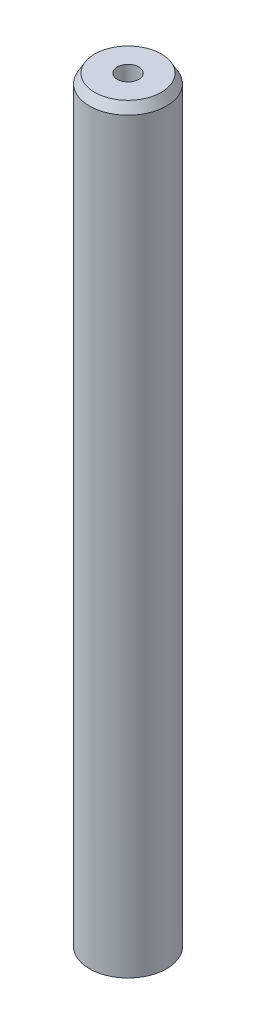
ISO-10303-21;
HEADER;
FILE_DESCRIPTION(('STEP AP214'),'2;1');
FILE_NAME('part.step','',(''),(''),'','','');
FILE_SCHEMA(('AUTOMOTIVE_DESIGN { 1 0 10303 214 1 1 1 1 }'));
ENDSEC;
DATA;
#1=APPLICATION_CONTEXT('core data for automotive mechanical design processes');
#2=APPLICATION_PROTOCOL_DEFINITION('international standard','automotive_design',2000,#1);
#3=PRODUCT_CONTEXT('',#1,'mechanical');
#4=PRODUCT('Part','Part','',(#3));
#5=PRODUCT_RELATED_PRODUCT_CATEGORY('part','',(#4));
#6=PRODUCT_DEFINITION_FORMATION('','',#4);
#7=PRODUCT_DEFINITION_CONTEXT('part definition',#1,'design');
#8=PRODUCT_DEFINITION('design','',#6,#7);
#9=PRODUCT_DEFINITION_SHAPE('','',#8);
#10=(LENGTH_UNIT() NAMED_UNIT(*) SI_UNIT(.MILLI.,.METRE.));
#11=(NAMED_UNIT(*) PLANE_ANGLE_UNIT() SI_UNIT($,.RADIAN.));
#12=(NAMED_UNIT(*) SI_UNIT($,.STERADIAN.) SOLID_ANGLE_UNIT());
#13=UNCERTAINTY_MEASURE_WITH_UNIT(LENGTH_MEASURE(1.E-05),#10,'distance_accuracy_value','');
#14=(GEOMETRIC_REPRESENTATION_CONTEXT(3) GLOBAL_UNCERTAINTY_ASSIGNED_CONTEXT((#13)) GLOBAL_UNIT_ASSIGNED_CONTEXT((#10,
#11,#12)) REPRESENTATION_CONTEXT('',''));
#15=CARTESIAN_POINT('',(0.,0.,0.));
#16=DIRECTION('',(0.,0.,1.));
#17=DIRECTION('',(1.,0.,0.));
#18=AXIS2_PLACEMENT_3D('',#15,#16,#17);
#19=CARTESIAN_POINT('',(0.,98.7222505478191,0.));
#20=DIRECTION('',(0.,-1.,0.));
#21=DIRECTION('',(0.,0.,-1.));
#22=AXIS2_PLACEMENT_3D('',#19,#20,#21);
#23=CYLINDRICAL_SURFACE('',#22,5.);
#24=CARTESIAN_POINT('',(0.,97.534723243453,0.));
#25=DIRECTION('',(0.,1.,0.));
#26=DIRECTION('',(0.,0.,1.));
#27=AXIS2_PLACEMENT_3D('',#24,#25,#26);
#28=CIRCLE('',#27,5.);
#29=CARTESIAN_POINT('',(0.,97.534723243453,-5.));
#30=VERTEX_POINT('',#29);
#31=EDGE_CURVE('E50',#30,#30,#28,.F.);
#32=ORIENTED_EDGE('',*,*,#31,.T.);
#33=EDGE_LOOP('',(#32));
#34=FACE_BOUND('',#33,.T.);
#35=CARTESIAN_POINT('',(0.,0.685619208845856,0.));
#36=DIRECTION('',(0.,1.,0.));
#37=DIRECTION('',(0.,0.,1.));
#38=AXIS2_PLACEMENT_3D('',#35,#36,#37);
#39=CIRCLE('',#38,5.);
#40=CARTESIAN_POINT('',(0.,0.685619208845856,5.));
#41=VERTEX_POINT('',#40);
#42=EDGE_CURVE('E51',#41,#41,#39,.T.);
#43=ORIENTED_EDGE('',*,*,#42,.T.);
#44=EDGE_LOOP('',(#43));
#45=FACE_BOUND('',#44,.T.);
#46=ADVANCED_FACE('F39',(#34,#45),#23,.T.);
#47=CARTESIAN_POINT('',(0.,98.7222505478191,0.));
#48=DIRECTION('',(0.,1.,0.));
#49=DIRECTION('',(0.,0.,1.));
#50=AXIS2_PLACEMENT_3D('',#47,#48,#49);
#51=PLANE('',#50);
#52=CARTESIAN_POINT('',(0.,98.7222505478191,0.));
#53=DIRECTION('',(0.,1.,0.));
#54=DIRECTION('',(0.,0.,1.));
#55=AXIS2_PLACEMENT_3D('',#52,#53,#54);
#56=CIRCLE('',#55,4.31438079115418);
#57=CARTESIAN_POINT('',(0.,98.7222505478191,-4.31438079115418));
#58=VERTEX_POINT('',#57);
#59=EDGE_CURVE('E54',#58,#58,#56,.T.);
#60=ORIENTED_EDGE('',*,*,#59,.T.);
#61=EDGE_LOOP('',(#60));
#62=FACE_BOUND('',#61,.T.);
#63=CARTESIAN_POINT('',(0.,98.7222505478191,0.));
#64=DIRECTION('',(0.,1.,0.));
#65=DIRECTION('',(0.,0.,1.));
#66=AXIS2_PLACEMENT_3D('',#63,#64,#65);
#67=CIRCLE('',#66,1.39909472275623);
#68=CARTESIAN_POINT('',(0.,98.7222505478191,1.39909472275623));
#69=VERTEX_POINT('',#68);
#70=EDGE_CURVE('E58',#69,#69,#67,.T.);
#71=ORIENTED_EDGE('',*,*,#70,.F.);
#72=EDGE_LOOP('',(#71));
#73=FACE_BOUND('',#72,.T.);
#74=ADVANCED_FACE('F69',(#62,#73),#51,.T.);
#75=CARTESIAN_POINT('',(0.,0.,0.));
#76=DIRECTION('',(0.,1.,0.));
#77=DIRECTION('',(0.,0.,1.));
#78=AXIS2_PLACEMENT_3D('',#75,#76,#77);
#79=PLANE('',#78);
#80=CARTESIAN_POINT('',(0.,0.,0.));
#81=DIRECTION('',(0.,1.,0.));
#82=DIRECTION('',(0.,0.,1.));
#83=AXIS2_PLACEMENT_3D('',#80,#81,#82);
#84=CIRCLE('',#83,3.8124726956338);
#85=CARTESIAN_POINT('',(0.,0.,3.8124726956338));
#86=VERTEX_POINT('',#85);
#87=EDGE_CURVE('E10',#86,#86,#84,.F.);
#88=ORIENTED_EDGE('',*,*,#87,.T.);
#89=EDGE_LOOP('',(#88));
#90=FACE_BOUND('',#89,.T.);
#91=CARTESIAN_POINT('',(0.,0.,0.));
#92=DIRECTION('',(0.,1.,0.));
#93=DIRECTION('',(0.,0.,1.));
#94=AXIS2_PLACEMENT_3D('',#91,#92,#93);
#95=CIRCLE('',#94,1.39909472275623);
#96=CARTESIAN_POINT('',(0.,0.,1.39909472275623));
#97=VERTEX_POINT('',#96);
#98=EDGE_CURVE('E63',#97,#97,#95,.T.);
#99=ORIENTED_EDGE('',*,*,#98,.T.);
#100=EDGE_LOOP('',(#99));
#101=FACE_BOUND('',#100,.T.);
#102=ADVANCED_FACE('F75',(#90,#101),#79,.F.);
#103=CARTESIAN_POINT('',(0.,98.7222505478191,0.));
#104=DIRECTION('',(0.,-1.,0.));
#105=DIRECTION('',(0.,0.,-1.));
#106=AXIS2_PLACEMENT_3D('',#103,#104,#105);
#107=CYLINDRICAL_SURFACE('',#106,1.39909472275623);
#108=ORIENTED_EDGE('',*,*,#70,.T.);
#109=EDGE_LOOP('',(#108));
#110=FACE_BOUND('',#109,.T.);
#111=ORIENTED_EDGE('',*,*,#98,.F.);
#112=EDGE_LOOP('',(#111));
#113=FACE_BOUND('',#112,.T.);
#114=ADVANCED_FACE('F70',(#110,#113),#107,.F.);
#115=CARTESIAN_POINT('',(0.,98.7222505478191,0.));
#116=DIRECTION('',(0.,-1.,0.));
#117=DIRECTION('',(0.,0.,-1.));
#118=AXIS2_PLACEMENT_3D('',#115,#116,#117);
#119=CONICAL_SURFACE('',#118,4.31438079115418,0.523598775598296);
#120=CARTESIAN_POINT('',(0.,97.534723243453,-5.));
#121=CARTESIAN_POINT('',(0.,97.5470933195401,-4.99285813324119));
#122=CARTESIAN_POINT('',(0.,97.5594633956272,-4.98571626648238));
#123=CARTESIAN_POINT('',(0.,97.5842035478016,-4.97143253296476));
#124=CARTESIAN_POINT('',(0.,97.5965736238887,-4.96429066620595));
#125=CARTESIAN_POINT('',(0.,97.621313776063,-4.95000693268833));
#126=CARTESIAN_POINT('',(0.,97.6336838521501,-4.94286506592952));
#127=CARTESIAN_POINT('',(0.,97.6584240043244,-4.9285813324119));
#128=CARTESIAN_POINT('',(0.,97.6707940804116,-4.92143946565309));
#129=CARTESIAN_POINT('',(0.,97.6955342325859,-4.90715573213546));
#130=CARTESIAN_POINT('',(0.,97.707904308673,-4.90001386537666));
#131=CARTESIAN_POINT('',(0.,97.7326444608473,-4.88573013185903));
#132=CARTESIAN_POINT('',(0.,97.7450145369345,-4.87858826510022));
#133=CARTESIAN_POINT('',(0.,97.7697546891088,-4.8643045315826));
#134=CARTESIAN_POINT('',(0.,97.7821247651959,-4.85716266482379));
#135=CARTESIAN_POINT('',(0.,97.8068649173702,-4.84287893130617));
#136=CARTESIAN_POINT('',(0.,97.8192349934573,-4.83573706454736));
#137=CARTESIAN_POINT('',(0.,97.8439751456316,-4.82145333102974));
#138=CARTESIAN_POINT('',(0.,97.8563452217188,-4.81431146427093));
#139=CARTESIAN_POINT('',(0.,97.8810853738931,-4.80002773075331));
#140=CARTESIAN_POINT('',(0.,97.8934554499802,-4.79288586399449));
#141=CARTESIAN_POINT('',(0.,97.9181956021545,-4.77860213047687));
#142=CARTESIAN_POINT('',(0.,97.9305656782417,-4.77146026371806));
#143=CARTESIAN_POINT('',(0.,97.955305830416,-4.75717653020044));
#144=CARTESIAN_POINT('',(0.,97.9676759065031,-4.75003466344163));
#145=CARTESIAN_POINT('',(0.,97.9924160586774,-4.73575092992401));
#146=CARTESIAN_POINT('',(0.,98.0047861347646,-4.7286090631652));
#147=CARTESIAN_POINT('',(0.,98.0295262869388,-4.71432532964758));
#148=CARTESIAN_POINT('',(0.,98.041896363026,-4.70718346288877));
#149=CARTESIAN_POINT('',(0.,98.0666365152003,-4.69289972937115));
#150=CARTESIAN_POINT('',(0.,98.0790065912875,-4.68575786261234));
#151=CARTESIAN_POINT('',(0.,98.1037467434617,-4.67147412909471));
#152=CARTESIAN_POINT('',(0.,98.1161168195489,-4.6643322623359));
#153=CARTESIAN_POINT('',(0.,98.1408569717232,-4.65004852881828));
#154=CARTESIAN_POINT('',(0.,98.1532270478103,-4.64290666205947));
#155=CARTESIAN_POINT('',(0.,98.1779671999846,-4.62862292854185));
#156=CARTESIAN_POINT('',(0.,98.1903372760718,-4.62148106178304));
#157=CARTESIAN_POINT('',(0.,98.2150774282461,-4.60719732826542));
#158=CARTESIAN_POINT('',(0.,98.2274475043332,-4.60005546150661));
#159=CARTESIAN_POINT('',(0.,98.2521876565075,-4.58577172798899));
#160=CARTESIAN_POINT('',(0.,98.2645577325947,-4.57862986123017));
#161=CARTESIAN_POINT('',(0.,98.289297884769,-4.56434612771255));
#162=CARTESIAN_POINT('',(0.,98.3016679608561,-4.55720426095374));
#163=CARTESIAN_POINT('',(0.,98.3264081130304,-4.54292052743612));
#164=CARTESIAN_POINT('',(0.,98.3387781891175,-4.53577866067731));
#165=CARTESIAN_POINT('',(0.,98.3635183412918,-4.52149492715969));
#166=CARTESIAN_POINT('',(0.,98.375888417379,-4.51435306040088));
#167=CARTESIAN_POINT('',(0.,98.4006285695533,-4.50006932688326));
#168=CARTESIAN_POINT('',(0.,98.4129986456404,-4.49292746012445));
#169=CARTESIAN_POINT('',(0.,98.4377387978147,-4.47864372660683));
#170=CARTESIAN_POINT('',(0.,98.4501088739019,-4.47150185984802));
#171=CARTESIAN_POINT('',(0.,98.4748490260762,-4.45721812633039));
#172=CARTESIAN_POINT('',(0.,98.4872191021633,-4.45007625957158));
#173=CARTESIAN_POINT('',(0.,98.5119592543376,-4.43579252605396));
#174=CARTESIAN_POINT('',(0.,98.5243293304247,-4.42865065929515));
#175=CARTESIAN_POINT('',(0.,98.5490694825991,-4.41436692577753));
#176=CARTESIAN_POINT('',(0.,98.5614395586862,-4.40722505901872));
#177=CARTESIAN_POINT('',(0.,98.5861797108605,-4.3929413255011));
#178=CARTESIAN_POINT('',(0.,98.5985497869476,-4.38579945874229));
#179=CARTESIAN_POINT('',(0.,98.6232899391219,-4.37151572522467));
#180=CARTESIAN_POINT('',(0.,98.6356600152091,-4.36437385846586));
#181=CARTESIAN_POINT('',(0.,98.6604001673834,-4.35009012494823));
#182=CARTESIAN_POINT('',(0.,98.6727702434705,-4.34294825818942));
#183=CARTESIAN_POINT('',(0.,98.6975103956448,-4.3286645246718));
#184=CARTESIAN_POINT('',(0.,98.709880471732,-4.32152265791299));
#185=CARTESIAN_POINT('',(0.,98.7222505478191,-4.31438079115418));
#186=B_SPLINE_CURVE_WITH_KNOTS('',3,(#120,#121,#122,#123,#124,#125,#126,#127,#128,#129,#130,
#131,#132,#133,#134,#135,#136,#137,#138,#139,#140,#141,#142,#143,#144,#145,#146,#147,#148,#149,
#150,#151,#152,#153,#154,#155,#156,#157,#158,#159,#160,#161,#162,#163,#164,#165,#166,#167,#168,
#169,#170,#171,#172,#173,#174,#175,#176,#177,#178,#179,#180,#181,#182,#183,#184,#185),
.UNSPECIFIED.,.F.,.F.,(4,2,2,2,2,2,2,2,2,2,2,2,2,2,2,2,2,2,2,2,2,2,2,2,2,2,2,2,2,2,2,2,4),(0.,
0.0428512005528661,0.0857024011057323,0.128553601658598,0.171404802211465,0.21425600276433,
0.257107203317196,0.29995840387005,0.342809604422917,0.385660804975783,0.428512005528649,
0.471363206081515,0.514214406634381,0.557065607187235,0.599916807740101,0.642768008292967,
0.685619208845833,0.728470409398699,0.771321609951565,0.814172810504431,0.857024011057285,
0.899875211610151,0.942726412163017,0.985577612715883,1.02842881326875,1.07128001382162,
1.11413121437447,1.15698241492734,1.1998336154802,1.24268481603307,1.28553601658593,
1.3283872171388,1.37123841769167),.UNSPECIFIED.);
#187=EDGE_CURVE('BSEAM81',#30,#58,#186,.T.);
#188=ORIENTED_EDGE('',*,*,#31,.F.);
#189=ORIENTED_EDGE('',*,*,#59,.F.);
#190=ORIENTED_EDGE('',*,*,#187,.T.);
#191=ORIENTED_EDGE('',*,*,#187,.F.);
#192=EDGE_LOOP('',(#188,#190,#189,#191));
#193=FACE_BOUND('',#192,.T.);
#194=ADVANCED_FACE('F81',(#193),#119,.T.);
#195=CARTESIAN_POINT('',(0.,0.685619208845856,0.));
#196=DIRECTION('',(0.,1.,0.));
#197=DIRECTION('',(0.,0.,1.));
#198=AXIS2_PLACEMENT_3D('',#195,#196,#197);
#199=CONICAL_SURFACE('',#198,5.,1.0471975511966);
#200=ORIENTED_EDGE('',*,*,#87,.F.);
#201=EDGE_LOOP('',(#200));
#202=FACE_BOUND('',#201,.T.);
#203=ORIENTED_EDGE('',*,*,#42,.F.);
#204=EDGE_LOOP('',(#203));
#205=FACE_BOUND('',#204,.T.);
#206=ADVANCED_FACE('F45',(#202,#205),#199,.T.);
#207=CLOSED_SHELL('',(#46,#74,#102,#114,#194,#206));
#208=MANIFOLD_SOLID_BREP('B2',#207);
#209=ADVANCED_BREP_SHAPE_REPRESENTATION('',(#18,#208),#14);
#210=SHAPE_DEFINITION_REPRESENTATION(#9,#209);
ENDSEC;
END-ISO-10303-21;
